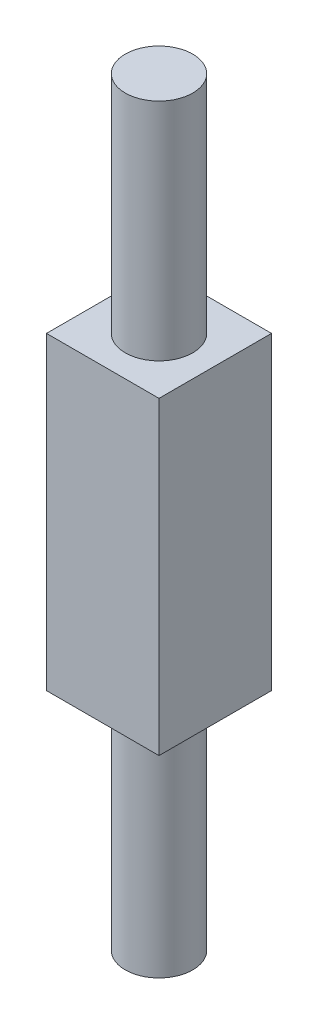
ISO-10303-21;
HEADER;
FILE_DESCRIPTION(('STEP AP214'),'2;1');
FILE_NAME('part.step','',(''),(''),'','','');
FILE_SCHEMA(('AUTOMOTIVE_DESIGN { 1 0 10303 214 1 1 1 1 }'));
ENDSEC;
DATA;
#1=APPLICATION_CONTEXT('core data for automotive mechanical design processes');
#2=APPLICATION_PROTOCOL_DEFINITION('international standard','automotive_design',2000,#1);
#3=PRODUCT_CONTEXT('',#1,'mechanical');
#4=PRODUCT('Part','Part','',(#3));
#5=PRODUCT_RELATED_PRODUCT_CATEGORY('part','',(#4));
#6=PRODUCT_DEFINITION_FORMATION('','',#4);
#7=PRODUCT_DEFINITION_CONTEXT('part definition',#1,'design');
#8=PRODUCT_DEFINITION('design','',#6,#7);
#9=PRODUCT_DEFINITION_SHAPE('','',#8);
#10=(LENGTH_UNIT() NAMED_UNIT(*) SI_UNIT(.MILLI.,.METRE.));
#11=(NAMED_UNIT(*) PLANE_ANGLE_UNIT() SI_UNIT($,.RADIAN.));
#12=(NAMED_UNIT(*) SI_UNIT($,.STERADIAN.) SOLID_ANGLE_UNIT());
#13=UNCERTAINTY_MEASURE_WITH_UNIT(LENGTH_MEASURE(1.E-05),#10,'distance_accuracy_value','');
#14=(GEOMETRIC_REPRESENTATION_CONTEXT(3) GLOBAL_UNCERTAINTY_ASSIGNED_CONTEXT((#13)) GLOBAL_UNIT_ASSIGNED_CONTEXT((#10,
#11,#12)) REPRESENTATION_CONTEXT('',''));
#15=CARTESIAN_POINT('',(0.,0.,0.));
#16=DIRECTION('',(0.,0.,1.));
#17=DIRECTION('',(1.,0.,0.));
#18=AXIS2_PLACEMENT_3D('',#15,#16,#17);
#19=CARTESIAN_POINT('',(0.,13.5,0.));
#20=DIRECTION('',(0.,-1.,0.));
#21=DIRECTION('',(0.,0.,-1.));
#22=AXIS2_PLACEMENT_3D('',#19,#20,#21);
#23=CYLINDRICAL_SURFACE('',#22,1.2);
#24=CARTESIAN_POINT('',(0.,5.5,0.));
#25=DIRECTION('',(0.,1.,0.));
#26=DIRECTION('',(0.,0.,1.));
#27=AXIS2_PLACEMENT_3D('',#24,#25,#26);
#28=CIRCLE('',#27,1.2);
#29=CARTESIAN_POINT('',(0.,5.5,1.2));
#30=VERTEX_POINT('',#29);
#31=EDGE_CURVE('E42',#30,#30,#28,.T.);
#32=ORIENTED_EDGE('',*,*,#31,.T.);
#33=EDGE_LOOP('',(#32));
#34=FACE_BOUND('',#33,.T.);
#35=CARTESIAN_POINT('',(0.,13.5,0.));
#36=DIRECTION('',(0.,1.,0.));
#37=DIRECTION('',(0.,0.,1.));
#38=AXIS2_PLACEMENT_3D('',#35,#36,#37);
#39=CIRCLE('',#38,1.2);
#40=CARTESIAN_POINT('',(0.,13.5,1.2));
#41=VERTEX_POINT('',#40);
#42=EDGE_CURVE('E49',#41,#41,#39,.T.);
#43=ORIENTED_EDGE('',*,*,#42,.F.);
#44=EDGE_LOOP('',(#43));
#45=FACE_BOUND('',#44,.T.);
#46=ADVANCED_FACE('F39',(#34,#45),#23,.T.);
#47=CARTESIAN_POINT('',(0.,13.5,0.));
#48=DIRECTION('',(0.,1.,0.));
#49=DIRECTION('',(0.,0.,1.));
#50=AXIS2_PLACEMENT_3D('',#47,#48,#49);
#51=PLANE('',#50);
#52=ORIENTED_EDGE('',*,*,#42,.T.);
#53=EDGE_LOOP('',(#52));
#54=FACE_BOUND('',#53,.T.);
#55=ADVANCED_FACE('F155',(#54),#51,.T.);
#56=CARTESIAN_POINT('',(-2.,5.5,2.));
#57=DIRECTION('',(1.,0.,0.));
#58=DIRECTION('',(0.,0.,-1.));
#59=AXIS2_PLACEMENT_3D('',#56,#57,#58);
#60=PLANE('',#59);
#61=DIRECTION('',(0.,0.,1.));
#62=VECTOR('',#61,1.);
#63=CARTESIAN_POINT('',(-2.,-5.5,2.));
#64=LINE('',#63,#62);
#65=CARTESIAN_POINT('',(-2.,-5.5,-2.));
#66=VERTEX_POINT('',#65);
#67=CARTESIAN_POINT('',(-2.,-5.5,2.));
#68=VERTEX_POINT('',#67);
#69=EDGE_CURVE('E112',#66,#68,#64,.T.);
#70=ORIENTED_EDGE('',*,*,#69,.T.);
#71=DIRECTION('',(0.,-1.,0.));
#72=VECTOR('',#71,1.);
#73=CARTESIAN_POINT('',(-2.,5.5,2.));
#74=LINE('',#73,#72);
#75=CARTESIAN_POINT('',(-2.,5.5,2.));
#76=VERTEX_POINT('',#75);
#77=EDGE_CURVE('E101',#76,#68,#74,.T.);
#78=ORIENTED_EDGE('',*,*,#77,.F.);
#79=DIRECTION('',(0.,0.,1.));
#80=VECTOR('',#79,1.);
#81=CARTESIAN_POINT('',(-2.,5.5,2.));
#82=LINE('',#81,#80);
#83=CARTESIAN_POINT('',(-2.,5.5,-2.));
#84=VERTEX_POINT('',#83);
#85=EDGE_CURVE('E93',#84,#76,#82,.T.);
#86=ORIENTED_EDGE('',*,*,#85,.F.);
#87=DIRECTION('',(0.,-1.,0.));
#88=VECTOR('',#87,1.);
#89=CARTESIAN_POINT('',(-2.,5.5,-2.));
#90=LINE('',#89,#88);
#91=EDGE_CURVE('E108',#84,#66,#90,.T.);
#92=ORIENTED_EDGE('',*,*,#91,.T.);
#93=EDGE_LOOP('',(#70,#78,#86,#92));
#94=FACE_BOUND('',#93,.T.);
#95=ADVANCED_FACE('F160',(#94),#60,.F.);
#96=CARTESIAN_POINT('',(2.,5.5,2.));
#97=DIRECTION('',(0.,0.,-1.));
#98=DIRECTION('',(-1.,0.,0.));
#99=AXIS2_PLACEMENT_3D('',#96,#97,#98);
#100=PLANE('',#99);
#101=DIRECTION('',(1.,0.,0.));
#102=VECTOR('',#101,1.);
#103=CARTESIAN_POINT('',(2.,-5.5,2.));
#104=LINE('',#103,#102);
#105=CARTESIAN_POINT('',(2.,-5.5,2.));
#106=VERTEX_POINT('',#105);
#107=EDGE_CURVE('E99',#68,#106,#104,.T.);
#108=ORIENTED_EDGE('',*,*,#107,.T.);
#109=DIRECTION('',(0.,-1.,0.));
#110=VECTOR('',#109,1.);
#111=CARTESIAN_POINT('',(2.,5.5,2.));
#112=LINE('',#111,#110);
#113=CARTESIAN_POINT('',(2.,5.5,2.));
#114=VERTEX_POINT('',#113);
#115=EDGE_CURVE('E97',#114,#106,#112,.T.);
#116=ORIENTED_EDGE('',*,*,#115,.F.);
#117=DIRECTION('',(1.,0.,0.));
#118=VECTOR('',#117,1.);
#119=CARTESIAN_POINT('',(2.,5.5,2.));
#120=LINE('',#119,#118);
#121=EDGE_CURVE('E88',#76,#114,#120,.T.);
#122=ORIENTED_EDGE('',*,*,#121,.F.);
#123=ORIENTED_EDGE('',*,*,#77,.T.);
#124=EDGE_LOOP('',(#108,#116,#122,#123));
#125=FACE_BOUND('',#124,.T.);
#126=ADVANCED_FACE('F98',(#125),#100,.F.);
#127=CARTESIAN_POINT('',(2.,5.5,2.));
#128=DIRECTION('',(-1.,0.,0.));
#129=DIRECTION('',(0.,0.,1.));
#130=AXIS2_PLACEMENT_3D('',#127,#128,#129);
#131=PLANE('',#130);
#132=DIRECTION('',(0.,0.,-1.));
#133=VECTOR('',#132,1.);
#134=CARTESIAN_POINT('',(2.,-5.5,2.));
#135=LINE('',#134,#133);
#136=CARTESIAN_POINT('',(2.,-5.5,-2.));
#137=VERTEX_POINT('',#136);
#138=EDGE_CURVE('E74',#106,#137,#135,.T.);
#139=ORIENTED_EDGE('',*,*,#138,.T.);
#140=DIRECTION('',(0.,-1.,0.));
#141=VECTOR('',#140,1.);
#142=CARTESIAN_POINT('',(2.,5.5,-2.));
#143=LINE('',#142,#141);
#144=CARTESIAN_POINT('',(2.,5.5,-2.));
#145=VERTEX_POINT('',#144);
#146=EDGE_CURVE('E102',#145,#137,#143,.T.);
#147=ORIENTED_EDGE('',*,*,#146,.F.);
#148=DIRECTION('',(0.,0.,-1.));
#149=VECTOR('',#148,1.);
#150=CARTESIAN_POINT('',(2.,5.5,2.));
#151=LINE('',#150,#149);
#152=EDGE_CURVE('E91',#114,#145,#151,.T.);
#153=ORIENTED_EDGE('',*,*,#152,.F.);
#154=ORIENTED_EDGE('',*,*,#115,.T.);
#155=EDGE_LOOP('',(#139,#147,#153,#154));
#156=FACE_BOUND('',#155,.T.);
#157=ADVANCED_FACE('F104',(#156),#131,.F.);
#158=CARTESIAN_POINT('',(2.,5.5,-2.));
#159=DIRECTION('',(0.,0.,1.));
#160=DIRECTION('',(1.,0.,0.));
#161=AXIS2_PLACEMENT_3D('',#158,#159,#160);
#162=PLANE('',#161);
#163=DIRECTION('',(-1.,0.,0.));
#164=VECTOR('',#163,1.);
#165=CARTESIAN_POINT('',(2.,-5.5,-2.));
#166=LINE('',#165,#164);
#167=EDGE_CURVE('E80',#137,#66,#166,.T.);
#168=ORIENTED_EDGE('',*,*,#167,.T.);
#169=ORIENTED_EDGE('',*,*,#91,.F.);
#170=DIRECTION('',(-1.,0.,0.));
#171=VECTOR('',#170,1.);
#172=CARTESIAN_POINT('',(2.,5.5,-2.));
#173=LINE('',#172,#171);
#174=EDGE_CURVE('E57',#145,#84,#173,.T.);
#175=ORIENTED_EDGE('',*,*,#174,.F.);
#176=ORIENTED_EDGE('',*,*,#146,.T.);
#177=EDGE_LOOP('',(#168,#169,#175,#176));
#178=FACE_BOUND('',#177,.T.);
#179=ADVANCED_FACE('F144',(#178),#162,.F.);
#180=CARTESIAN_POINT('',(0.,5.5,0.));
#181=DIRECTION('',(0.,1.,0.));
#182=DIRECTION('',(0.,0.,1.));
#183=AXIS2_PLACEMENT_3D('',#180,#181,#182);
#184=PLANE('',#183);
#185=ORIENTED_EDGE('',*,*,#31,.F.);
#186=EDGE_LOOP('',(#185));
#187=FACE_BOUND('',#186,.T.);
#188=ORIENTED_EDGE('',*,*,#85,.T.);
#189=ORIENTED_EDGE('',*,*,#121,.T.);
#190=ORIENTED_EDGE('',*,*,#152,.T.);
#191=ORIENTED_EDGE('',*,*,#174,.T.);
#192=EDGE_LOOP('',(#188,#189,#190,#191));
#193=FACE_BOUND('',#192,.T.);
#194=ADVANCED_FACE('F89',(#187,#193),#184,.T.);
#195=CARTESIAN_POINT('',(0.,-5.5,0.));
#196=DIRECTION('',(0.,1.,0.));
#197=DIRECTION('',(0.,0.,1.));
#198=AXIS2_PLACEMENT_3D('',#195,#196,#197);
#199=PLANE('',#198);
#200=CARTESIAN_POINT('',(0.,-5.5,0.));
#201=DIRECTION('',(0.,1.,0.));
#202=DIRECTION('',(0.,0.,1.));
#203=AXIS2_PLACEMENT_3D('',#200,#201,#202);
#204=CIRCLE('',#203,1.2);
#205=CARTESIAN_POINT('',(0.,-5.5,1.2));
#206=VERTEX_POINT('',#205);
#207=EDGE_CURVE('E11',#206,#206,#204,.T.);
#208=ORIENTED_EDGE('',*,*,#207,.T.);
#209=EDGE_LOOP('',(#208));
#210=FACE_BOUND('',#209,.T.);
#211=ORIENTED_EDGE('',*,*,#69,.F.);
#212=ORIENTED_EDGE('',*,*,#167,.F.);
#213=ORIENTED_EDGE('',*,*,#138,.F.);
#214=ORIENTED_EDGE('',*,*,#107,.F.);
#215=EDGE_LOOP('',(#211,#212,#213,#214));
#216=FACE_BOUND('',#215,.T.);
#217=ADVANCED_FACE('F143',(#210,#216),#199,.F.);
#218=CARTESIAN_POINT('',(0.,-13.5,0.));
#219=DIRECTION('',(0.,1.,0.));
#220=DIRECTION('',(0.,0.,1.));
#221=AXIS2_PLACEMENT_3D('',#218,#219,#220);
#222=PLANE('',#221);
#223=CARTESIAN_POINT('',(0.,-13.5,0.));
#224=DIRECTION('',(0.,1.,0.));
#225=DIRECTION('',(0.,0.,1.));
#226=AXIS2_PLACEMENT_3D('',#223,#224,#225);
#227=CIRCLE('',#226,1.2);
#228=CARTESIAN_POINT('',(0.,-13.5,1.2));
#229=VERTEX_POINT('',#228);
#230=EDGE_CURVE('E131',#229,#229,#227,.T.);
#231=ORIENTED_EDGE('',*,*,#230,.F.);
#232=EDGE_LOOP('',(#231));
#233=FACE_BOUND('',#232,.T.);
#234=ADVANCED_FACE('F150',(#233),#222,.F.);
#235=ORIENTED_EDGE('',*,*,#230,.T.);
#236=EDGE_LOOP('',(#235));
#237=FACE_BOUND('',#236,.T.);
#238=ORIENTED_EDGE('',*,*,#207,.F.);
#239=EDGE_LOOP('',(#238));
#240=FACE_BOUND('',#239,.T.);
#241=ADVANCED_FACE('F156',(#237,#240),#23,.T.);
#242=CLOSED_SHELL('',(#46,#55,#95,#126,#157,#179,#194,#217,#234,#241));
#243=MANIFOLD_SOLID_BREP('B2',#242);
#244=ADVANCED_BREP_SHAPE_REPRESENTATION('',(#18,#243),#14);
#245=SHAPE_DEFINITION_REPRESENTATION(#9,#244);
ENDSEC;
END-ISO-10303-21;
